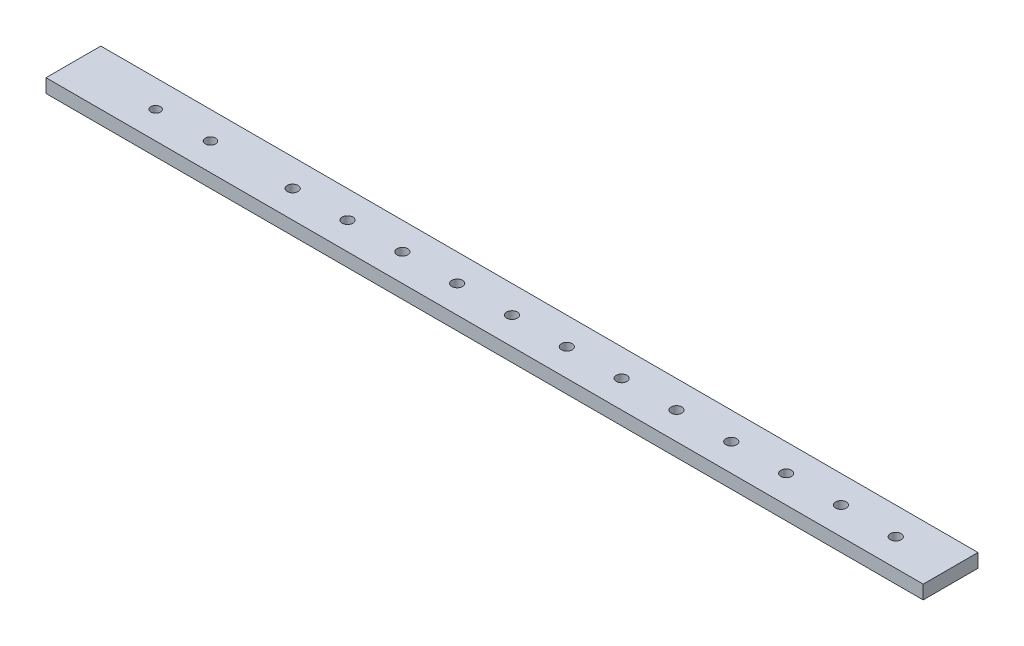
ISO-10303-21;
HEADER;
FILE_DESCRIPTION(('STEP AP214'),'2;1');
FILE_NAME('part.step','',(''),(''),'','','');
FILE_SCHEMA(('AUTOMOTIVE_DESIGN { 1 0 10303 214 1 1 1 1 }'));
ENDSEC;
DATA;
#1=APPLICATION_CONTEXT('core data for automotive mechanical design processes');
#2=APPLICATION_PROTOCOL_DEFINITION('international standard','automotive_design',2000,#1);
#3=PRODUCT_CONTEXT('',#1,'mechanical');
#4=PRODUCT('Part','Part','',(#3));
#5=PRODUCT_RELATED_PRODUCT_CATEGORY('part','',(#4));
#6=PRODUCT_DEFINITION_FORMATION('','',#4);
#7=PRODUCT_DEFINITION_CONTEXT('part definition',#1,'design');
#8=PRODUCT_DEFINITION('design','',#6,#7);
#9=PRODUCT_DEFINITION_SHAPE('','',#8);
#10=(LENGTH_UNIT() NAMED_UNIT(*) SI_UNIT(.MILLI.,.METRE.));
#11=(NAMED_UNIT(*) PLANE_ANGLE_UNIT() SI_UNIT($,.RADIAN.));
#12=(NAMED_UNIT(*) SI_UNIT($,.STERADIAN.) SOLID_ANGLE_UNIT());
#13=UNCERTAINTY_MEASURE_WITH_UNIT(LENGTH_MEASURE(1.E-05),#10,'distance_accuracy_value','');
#14=(GEOMETRIC_REPRESENTATION_CONTEXT(3) GLOBAL_UNCERTAINTY_ASSIGNED_CONTEXT((#13)) GLOBAL_UNIT_ASSIGNED_CONTEXT((#10,
#11,#12)) REPRESENTATION_CONTEXT('',''));
#15=CARTESIAN_POINT('',(0.,0.,0.));
#16=DIRECTION('',(0.,0.,1.));
#17=DIRECTION('',(1.,0.,0.));
#18=AXIS2_PLACEMENT_3D('',#15,#16,#17);
#19=CARTESIAN_POINT('',(0.,6.35,0.));
#20=DIRECTION('',(1.,0.,0.));
#21=DIRECTION('',(0.,0.,-1.));
#22=AXIS2_PLACEMENT_3D('',#19,#20,#21);
#23=PLANE('',#22);
#24=DIRECTION('',(0.,0.,1.));
#25=VECTOR('',#24,1.);
#26=CARTESIAN_POINT('',(0.,0.,0.));
#27=LINE('',#26,#25);
#28=CARTESIAN_POINT('',(0.,0.,-25.4));
#29=VERTEX_POINT('',#28);
#30=CARTESIAN_POINT('',(0.,0.,0.));
#31=VERTEX_POINT('',#30);
#32=EDGE_CURVE('E96',#29,#31,#27,.T.);
#33=ORIENTED_EDGE('',*,*,#32,.T.);
#34=DIRECTION('',(0.,-1.,0.));
#35=VECTOR('',#34,1.);
#36=CARTESIAN_POINT('',(0.,6.35,0.));
#37=LINE('',#36,#35);
#38=CARTESIAN_POINT('',(0.,6.35,0.));
#39=VERTEX_POINT('',#38);
#40=EDGE_CURVE('E11',#39,#31,#37,.T.);
#41=ORIENTED_EDGE('',*,*,#40,.F.);
#42=DIRECTION('',(0.,0.,1.));
#43=VECTOR('',#42,1.);
#44=CARTESIAN_POINT('',(0.,6.35,0.));
#45=LINE('',#44,#43);
#46=CARTESIAN_POINT('',(0.,6.35,-25.4));
#47=VERTEX_POINT('',#46);
#48=EDGE_CURVE('E84',#47,#39,#45,.T.);
#49=ORIENTED_EDGE('',*,*,#48,.F.);
#50=DIRECTION('',(0.,-1.,0.));
#51=VECTOR('',#50,1.);
#52=CARTESIAN_POINT('',(0.,6.35,-25.4));
#53=LINE('',#52,#51);
#54=EDGE_CURVE('E92',#47,#29,#53,.T.);
#55=ORIENTED_EDGE('',*,*,#54,.T.);
#56=EDGE_LOOP('',(#33,#41,#49,#55));
#57=FACE_BOUND('',#56,.T.);
#58=ADVANCED_FACE('F33',(#57),#23,.F.);
#59=CARTESIAN_POINT('',(0.,6.35,0.));
#60=DIRECTION('',(0.,0.,-1.));
#61=DIRECTION('',(-1.,0.,0.));
#62=AXIS2_PLACEMENT_3D('',#59,#60,#61);
#63=PLANE('',#62);
#64=DIRECTION('',(1.,0.,0.));
#65=VECTOR('',#64,1.);
#66=CARTESIAN_POINT('',(0.,0.,0.));
#67=LINE('',#66,#65);
#68=CARTESIAN_POINT('',(406.4,0.,0.));
#69=VERTEX_POINT('',#68);
#70=EDGE_CURVE('E88',#31,#69,#67,.T.);
#71=ORIENTED_EDGE('',*,*,#70,.T.);
#72=DIRECTION('',(0.,-1.,0.));
#73=VECTOR('',#72,1.);
#74=CARTESIAN_POINT('',(406.4,6.35,0.));
#75=LINE('',#74,#73);
#76=CARTESIAN_POINT('',(406.4,6.35,0.));
#77=VERTEX_POINT('',#76);
#78=EDGE_CURVE('E41',#77,#69,#75,.T.);
#79=ORIENTED_EDGE('',*,*,#78,.F.);
#80=DIRECTION('',(1.,0.,0.));
#81=VECTOR('',#80,1.);
#82=CARTESIAN_POINT('',(0.,6.35,0.));
#83=LINE('',#82,#81);
#84=EDGE_CURVE('E79',#39,#77,#83,.T.);
#85=ORIENTED_EDGE('',*,*,#84,.F.);
#86=ORIENTED_EDGE('',*,*,#40,.T.);
#87=EDGE_LOOP('',(#71,#79,#85,#86));
#88=FACE_BOUND('',#87,.T.);
#89=ADVANCED_FACE('F87',(#88),#63,.F.);
#90=CARTESIAN_POINT('',(406.4,6.35,0.));
#91=DIRECTION('',(-1.,0.,0.));
#92=DIRECTION('',(0.,0.,1.));
#93=AXIS2_PLACEMENT_3D('',#90,#91,#92);
#94=PLANE('',#93);
#95=DIRECTION('',(0.,0.,-1.));
#96=VECTOR('',#95,1.);
#97=CARTESIAN_POINT('',(406.4,0.,0.));
#98=LINE('',#97,#96);
#99=CARTESIAN_POINT('',(406.4,0.,-25.4));
#100=VERTEX_POINT('',#99);
#101=EDGE_CURVE('E66',#69,#100,#98,.T.);
#102=ORIENTED_EDGE('',*,*,#101,.T.);
#103=DIRECTION('',(0.,-1.,0.));
#104=VECTOR('',#103,1.);
#105=CARTESIAN_POINT('',(406.4,6.35,-25.4));
#106=LINE('',#105,#104);
#107=CARTESIAN_POINT('',(406.4,6.35,-25.4));
#108=VERTEX_POINT('',#107);
#109=EDGE_CURVE('E89',#108,#100,#106,.T.);
#110=ORIENTED_EDGE('',*,*,#109,.F.);
#111=DIRECTION('',(0.,0.,-1.));
#112=VECTOR('',#111,1.);
#113=CARTESIAN_POINT('',(406.4,6.35,0.));
#114=LINE('',#113,#112);
#115=EDGE_CURVE('E82',#77,#108,#114,.T.);
#116=ORIENTED_EDGE('',*,*,#115,.F.);
#117=ORIENTED_EDGE('',*,*,#78,.T.);
#118=EDGE_LOOP('',(#102,#110,#116,#117));
#119=FACE_BOUND('',#118,.T.);
#120=ADVANCED_FACE('F90',(#119),#94,.F.);
#121=CARTESIAN_POINT('',(0.,6.35,-25.4));
#122=DIRECTION('',(0.,0.,1.));
#123=DIRECTION('',(1.,0.,0.));
#124=AXIS2_PLACEMENT_3D('',#121,#122,#123);
#125=PLANE('',#124);
#126=DIRECTION('',(-1.,0.,0.));
#127=VECTOR('',#126,1.);
#128=CARTESIAN_POINT('',(0.,0.,-25.4));
#129=LINE('',#128,#127);
#130=EDGE_CURVE('E72',#100,#29,#129,.T.);
#131=ORIENTED_EDGE('',*,*,#130,.T.);
#132=ORIENTED_EDGE('',*,*,#54,.F.);
#133=DIRECTION('',(-1.,0.,0.));
#134=VECTOR('',#133,1.);
#135=CARTESIAN_POINT('',(0.,6.35,-25.4));
#136=LINE('',#135,#134);
#137=EDGE_CURVE('E49',#108,#47,#136,.T.);
#138=ORIENTED_EDGE('',*,*,#137,.F.);
#139=ORIENTED_EDGE('',*,*,#109,.T.);
#140=EDGE_LOOP('',(#131,#132,#138,#139));
#141=FACE_BOUND('',#140,.T.);
#142=ADVANCED_FACE('F104',(#141),#125,.F.);
#143=CARTESIAN_POINT('',(0.,6.35,0.));
#144=DIRECTION('',(0.,-1.,0.));
#145=DIRECTION('',(0.,0.,-1.));
#146=AXIS2_PLACEMENT_3D('',#143,#144,#145);
#147=PLANE('',#146);
#148=CARTESIAN_POINT('',(63.4999999999983,6.35,-12.7000000000005));
#149=DIRECTION('',(0.,-1.,0.));
#150=DIRECTION('',(0.,0.,-1.));
#151=AXIS2_PLACEMENT_3D('',#148,#149,#150);
#152=CIRCLE('',#151,2.37807027929824);
#153=CARTESIAN_POINT('',(63.4999999999983,6.35,-15.0780702792988));
#154=VERTEX_POINT('',#153);
#155=EDGE_CURVE('E114',#154,#154,#152,.T.);
#156=ORIENTED_EDGE('',*,*,#155,.T.);
#157=EDGE_LOOP('',(#156));
#158=FACE_BOUND('',#157,.T.);
#159=CARTESIAN_POINT('',(38.0999999999999,6.35,-12.7000000000003));
#160=DIRECTION('',(0.,-1.,0.));
#161=DIRECTION('',(0.,0.,-1.));
#162=AXIS2_PLACEMENT_3D('',#159,#160,#161);
#163=CIRCLE('',#162,2.20737702969535);
#164=CARTESIAN_POINT('',(38.0999999999999,6.35,-14.9073770296957));
#165=VERTEX_POINT('',#164);
#166=EDGE_CURVE('E185',#165,#165,#163,.T.);
#167=ORIENTED_EDGE('',*,*,#166,.T.);
#168=EDGE_LOOP('',(#167));
#169=FACE_BOUND('',#168,.T.);
#170=CARTESIAN_POINT('',(381.,6.35,-12.7));
#171=DIRECTION('',(0.,1.,0.));
#172=DIRECTION('',(0.,0.,1.));
#173=AXIS2_PLACEMENT_3D('',#170,#171,#172);
#174=CIRCLE('',#173,2.48920000000001);
#175=CARTESIAN_POINT('',(381.,6.35,-10.2108));
#176=VERTEX_POINT('',#175);
#177=EDGE_CURVE('E177',#176,#176,#174,.T.);
#178=ORIENTED_EDGE('',*,*,#177,.F.);
#179=EDGE_LOOP('',(#178));
#180=FACE_BOUND('',#179,.T.);
#181=CARTESIAN_POINT('',(355.6,6.35,-12.7));
#182=DIRECTION('',(0.,1.,0.));
#183=DIRECTION('',(0.,0.,1.));
#184=AXIS2_PLACEMENT_3D('',#181,#182,#183);
#185=CIRCLE('',#184,2.48920000000001);
#186=CARTESIAN_POINT('',(355.6,6.35,-10.2108));
#187=VERTEX_POINT('',#186);
#188=EDGE_CURVE('E171',#187,#187,#185,.T.);
#189=ORIENTED_EDGE('',*,*,#188,.F.);
#190=EDGE_LOOP('',(#189));
#191=FACE_BOUND('',#190,.T.);
#192=CARTESIAN_POINT('',(330.2,6.35,-12.7));
#193=DIRECTION('',(0.,1.,0.));
#194=DIRECTION('',(0.,0.,1.));
#195=AXIS2_PLACEMENT_3D('',#192,#193,#194);
#196=CIRCLE('',#195,2.48920000000001);
#197=CARTESIAN_POINT('',(330.2,6.35,-10.2108));
#198=VERTEX_POINT('',#197);
#199=EDGE_CURVE('E165',#198,#198,#196,.T.);
#200=ORIENTED_EDGE('',*,*,#199,.F.);
#201=EDGE_LOOP('',(#200));
#202=FACE_BOUND('',#201,.T.);
#203=CARTESIAN_POINT('',(304.8,6.35,-12.7));
#204=DIRECTION('',(0.,1.,0.));
#205=DIRECTION('',(0.,0.,1.));
#206=AXIS2_PLACEMENT_3D('',#203,#204,#205);
#207=CIRCLE('',#206,2.48920000000001);
#208=CARTESIAN_POINT('',(304.8,6.35,-10.2108));
#209=VERTEX_POINT('',#208);
#210=EDGE_CURVE('E159',#209,#209,#207,.T.);
#211=ORIENTED_EDGE('',*,*,#210,.F.);
#212=EDGE_LOOP('',(#211));
#213=FACE_BOUND('',#212,.T.);
#214=CARTESIAN_POINT('',(279.4,6.35,-12.7));
#215=DIRECTION('',(0.,1.,0.));
#216=DIRECTION('',(0.,0.,1.));
#217=AXIS2_PLACEMENT_3D('',#214,#215,#216);
#218=CIRCLE('',#217,2.48920000000001);
#219=CARTESIAN_POINT('',(279.4,6.35,-10.2108));
#220=VERTEX_POINT('',#219);
#221=EDGE_CURVE('E153',#220,#220,#218,.T.);
#222=ORIENTED_EDGE('',*,*,#221,.F.);
#223=EDGE_LOOP('',(#222));
#224=FACE_BOUND('',#223,.T.);
#225=CARTESIAN_POINT('',(254.,6.35,-12.7));
#226=DIRECTION('',(0.,1.,0.));
#227=DIRECTION('',(0.,0.,1.));
#228=AXIS2_PLACEMENT_3D('',#225,#226,#227);
#229=CIRCLE('',#228,2.48920000000001);
#230=CARTESIAN_POINT('',(254.,6.35,-10.2108));
#231=VERTEX_POINT('',#230);
#232=EDGE_CURVE('E147',#231,#231,#229,.T.);
#233=ORIENTED_EDGE('',*,*,#232,.F.);
#234=EDGE_LOOP('',(#233));
#235=FACE_BOUND('',#234,.T.);
#236=CARTESIAN_POINT('',(228.6,6.35,-12.7));
#237=DIRECTION('',(0.,1.,0.));
#238=DIRECTION('',(0.,0.,1.));
#239=AXIS2_PLACEMENT_3D('',#236,#237,#238);
#240=CIRCLE('',#239,2.4892);
#241=CARTESIAN_POINT('',(228.6,6.35,-10.2108));
#242=VERTEX_POINT('',#241);
#243=EDGE_CURVE('E141',#242,#242,#240,.T.);
#244=ORIENTED_EDGE('',*,*,#243,.F.);
#245=EDGE_LOOP('',(#244));
#246=FACE_BOUND('',#245,.T.);
#247=CARTESIAN_POINT('',(203.2,6.35,-12.7));
#248=DIRECTION('',(0.,1.,0.));
#249=DIRECTION('',(0.,0.,1.));
#250=AXIS2_PLACEMENT_3D('',#247,#248,#249);
#251=CIRCLE('',#250,2.4892);
#252=CARTESIAN_POINT('',(203.2,6.35,-10.2108));
#253=VERTEX_POINT('',#252);
#254=EDGE_CURVE('E135',#253,#253,#251,.T.);
#255=ORIENTED_EDGE('',*,*,#254,.F.);
#256=EDGE_LOOP('',(#255));
#257=FACE_BOUND('',#256,.T.);
#258=CARTESIAN_POINT('',(177.8,6.35,-12.7));
#259=DIRECTION('',(0.,1.,0.));
#260=DIRECTION('',(0.,0.,1.));
#261=AXIS2_PLACEMENT_3D('',#258,#259,#260);
#262=CIRCLE('',#261,2.4892);
#263=CARTESIAN_POINT('',(177.8,6.35,-10.2108));
#264=VERTEX_POINT('',#263);
#265=EDGE_CURVE('E129',#264,#264,#262,.T.);
#266=ORIENTED_EDGE('',*,*,#265,.F.);
#267=EDGE_LOOP('',(#266));
#268=FACE_BOUND('',#267,.T.);
#269=CARTESIAN_POINT('',(152.4,6.35,-12.7));
#270=DIRECTION('',(0.,1.,0.));
#271=DIRECTION('',(0.,0.,1.));
#272=AXIS2_PLACEMENT_3D('',#269,#270,#271);
#273=CIRCLE('',#272,2.4892);
#274=CARTESIAN_POINT('',(152.4,6.35,-10.2108));
#275=VERTEX_POINT('',#274);
#276=EDGE_CURVE('E123',#275,#275,#273,.T.);
#277=ORIENTED_EDGE('',*,*,#276,.F.);
#278=EDGE_LOOP('',(#277));
#279=FACE_BOUND('',#278,.T.);
#280=CARTESIAN_POINT('',(127.,6.35,-12.7));
#281=DIRECTION('',(0.,1.,0.));
#282=DIRECTION('',(0.,0.,1.));
#283=AXIS2_PLACEMENT_3D('',#280,#281,#282);
#284=CIRCLE('',#283,2.4892);
#285=CARTESIAN_POINT('',(127.,6.35,-10.2108));
#286=VERTEX_POINT('',#285);
#287=EDGE_CURVE('E117',#286,#286,#284,.T.);
#288=ORIENTED_EDGE('',*,*,#287,.F.);
#289=EDGE_LOOP('',(#288));
#290=FACE_BOUND('',#289,.T.);
#291=CARTESIAN_POINT('',(101.6,6.35,-12.7));
#292=DIRECTION('',(0.,1.,0.));
#293=DIRECTION('',(0.,0.,1.));
#294=AXIS2_PLACEMENT_3D('',#291,#292,#293);
#295=CIRCLE('',#294,2.4892);
#296=CARTESIAN_POINT('',(101.6,6.35,-10.2108));
#297=VERTEX_POINT('',#296);
#298=EDGE_CURVE('E110',#297,#297,#295,.T.);
#299=ORIENTED_EDGE('',*,*,#298,.F.);
#300=EDGE_LOOP('',(#299));
#301=FACE_BOUND('',#300,.T.);
#302=ORIENTED_EDGE('',*,*,#48,.T.);
#303=ORIENTED_EDGE('',*,*,#84,.T.);
#304=ORIENTED_EDGE('',*,*,#115,.T.);
#305=ORIENTED_EDGE('',*,*,#137,.T.);
#306=EDGE_LOOP('',(#302,#303,#304,#305));
#307=FACE_BOUND('',#306,.T.);
#308=ADVANCED_FACE('F80',(#158,#169,#180,#191,#202,#213,#224,#235,#246,#257,#268,#279,#290,#301,
#307),#147,.F.);
#309=CARTESIAN_POINT('',(0.,0.,0.));
#310=DIRECTION('',(0.,-1.,0.));
#311=DIRECTION('',(0.,0.,-1.));
#312=AXIS2_PLACEMENT_3D('',#309,#310,#311);
#313=PLANE('',#312);
#314=CARTESIAN_POINT('',(63.4999999999983,0.,-12.7000000000005));
#315=DIRECTION('',(0.,-1.,0.));
#316=DIRECTION('',(0.,0.,-1.));
#317=AXIS2_PLACEMENT_3D('',#314,#315,#316);
#318=CIRCLE('',#317,2.37807027929824);
#319=CARTESIAN_POINT('',(63.4999999999983,0.,-15.0780702792988));
#320=VERTEX_POINT('',#319);
#321=EDGE_CURVE('E188',#320,#320,#318,.T.);
#322=ORIENTED_EDGE('',*,*,#321,.F.);
#323=EDGE_LOOP('',(#322));
#324=FACE_BOUND('',#323,.T.);
#325=CARTESIAN_POINT('',(38.0999999999999,0.,-12.7000000000003));
#326=DIRECTION('',(0.,-1.,0.));
#327=DIRECTION('',(0.,0.,-1.));
#328=AXIS2_PLACEMENT_3D('',#325,#326,#327);
#329=CIRCLE('',#328,2.20737702969535);
#330=CARTESIAN_POINT('',(38.0999999999999,0.,-14.9073770296957));
#331=VERTEX_POINT('',#330);
#332=EDGE_CURVE('E182',#331,#331,#329,.T.);
#333=ORIENTED_EDGE('',*,*,#332,.F.);
#334=EDGE_LOOP('',(#333));
#335=FACE_BOUND('',#334,.T.);
#336=CARTESIAN_POINT('',(381.,0.,-12.7));
#337=DIRECTION('',(0.,1.,0.));
#338=DIRECTION('',(0.,0.,1.));
#339=AXIS2_PLACEMENT_3D('',#336,#337,#338);
#340=CIRCLE('',#339,2.48920000000001);
#341=CARTESIAN_POINT('',(381.,0.,-10.2108));
#342=VERTEX_POINT('',#341);
#343=EDGE_CURVE('E99',#342,#342,#340,.T.);
#344=ORIENTED_EDGE('',*,*,#343,.T.);
#345=EDGE_LOOP('',(#344));
#346=FACE_BOUND('',#345,.T.);
#347=CARTESIAN_POINT('',(355.6,0.,-12.7));
#348=DIRECTION('',(0.,1.,0.));
#349=DIRECTION('',(0.,0.,1.));
#350=AXIS2_PLACEMENT_3D('',#347,#348,#349);
#351=CIRCLE('',#350,2.48920000000001);
#352=CARTESIAN_POINT('',(355.6,0.,-10.2108));
#353=VERTEX_POINT('',#352);
#354=EDGE_CURVE('E174',#353,#353,#351,.T.);
#355=ORIENTED_EDGE('',*,*,#354,.T.);
#356=EDGE_LOOP('',(#355));
#357=FACE_BOUND('',#356,.T.);
#358=CARTESIAN_POINT('',(330.2,0.,-12.7));
#359=DIRECTION('',(0.,1.,0.));
#360=DIRECTION('',(0.,0.,1.));
#361=AXIS2_PLACEMENT_3D('',#358,#359,#360);
#362=CIRCLE('',#361,2.48920000000001);
#363=CARTESIAN_POINT('',(330.2,0.,-10.2108));
#364=VERTEX_POINT('',#363);
#365=EDGE_CURVE('E168',#364,#364,#362,.T.);
#366=ORIENTED_EDGE('',*,*,#365,.T.);
#367=EDGE_LOOP('',(#366));
#368=FACE_BOUND('',#367,.T.);
#369=CARTESIAN_POINT('',(304.8,0.,-12.7));
#370=DIRECTION('',(0.,1.,0.));
#371=DIRECTION('',(0.,0.,1.));
#372=AXIS2_PLACEMENT_3D('',#369,#370,#371);
#373=CIRCLE('',#372,2.48920000000001);
#374=CARTESIAN_POINT('',(304.8,0.,-10.2108));
#375=VERTEX_POINT('',#374);
#376=EDGE_CURVE('E162',#375,#375,#373,.T.);
#377=ORIENTED_EDGE('',*,*,#376,.T.);
#378=EDGE_LOOP('',(#377));
#379=FACE_BOUND('',#378,.T.);
#380=CARTESIAN_POINT('',(279.4,0.,-12.7));
#381=DIRECTION('',(0.,1.,0.));
#382=DIRECTION('',(0.,0.,1.));
#383=AXIS2_PLACEMENT_3D('',#380,#381,#382);
#384=CIRCLE('',#383,2.48920000000001);
#385=CARTESIAN_POINT('',(279.4,0.,-10.2108));
#386=VERTEX_POINT('',#385);
#387=EDGE_CURVE('E156',#386,#386,#384,.T.);
#388=ORIENTED_EDGE('',*,*,#387,.T.);
#389=EDGE_LOOP('',(#388));
#390=FACE_BOUND('',#389,.T.);
#391=CARTESIAN_POINT('',(254.,0.,-12.7));
#392=DIRECTION('',(0.,1.,0.));
#393=DIRECTION('',(0.,0.,1.));
#394=AXIS2_PLACEMENT_3D('',#391,#392,#393);
#395=CIRCLE('',#394,2.48920000000001);
#396=CARTESIAN_POINT('',(254.,0.,-10.2108));
#397=VERTEX_POINT('',#396);
#398=EDGE_CURVE('E150',#397,#397,#395,.T.);
#399=ORIENTED_EDGE('',*,*,#398,.T.);
#400=EDGE_LOOP('',(#399));
#401=FACE_BOUND('',#400,.T.);
#402=CARTESIAN_POINT('',(228.6,0.,-12.7));
#403=DIRECTION('',(0.,1.,0.));
#404=DIRECTION('',(0.,0.,1.));
#405=AXIS2_PLACEMENT_3D('',#402,#403,#404);
#406=CIRCLE('',#405,2.4892);
#407=CARTESIAN_POINT('',(228.6,0.,-10.2108));
#408=VERTEX_POINT('',#407);
#409=EDGE_CURVE('E144',#408,#408,#406,.T.);
#410=ORIENTED_EDGE('',*,*,#409,.T.);
#411=EDGE_LOOP('',(#410));
#412=FACE_BOUND('',#411,.T.);
#413=CARTESIAN_POINT('',(203.2,0.,-12.7));
#414=DIRECTION('',(0.,1.,0.));
#415=DIRECTION('',(0.,0.,1.));
#416=AXIS2_PLACEMENT_3D('',#413,#414,#415);
#417=CIRCLE('',#416,2.4892);
#418=CARTESIAN_POINT('',(203.2,0.,-10.2108));
#419=VERTEX_POINT('',#418);
#420=EDGE_CURVE('E138',#419,#419,#417,.T.);
#421=ORIENTED_EDGE('',*,*,#420,.T.);
#422=EDGE_LOOP('',(#421));
#423=FACE_BOUND('',#422,.T.);
#424=CARTESIAN_POINT('',(177.8,0.,-12.7));
#425=DIRECTION('',(0.,1.,0.));
#426=DIRECTION('',(0.,0.,1.));
#427=AXIS2_PLACEMENT_3D('',#424,#425,#426);
#428=CIRCLE('',#427,2.4892);
#429=CARTESIAN_POINT('',(177.8,0.,-10.2108));
#430=VERTEX_POINT('',#429);
#431=EDGE_CURVE('E132',#430,#430,#428,.T.);
#432=ORIENTED_EDGE('',*,*,#431,.T.);
#433=EDGE_LOOP('',(#432));
#434=FACE_BOUND('',#433,.T.);
#435=CARTESIAN_POINT('',(152.4,0.,-12.7));
#436=DIRECTION('',(0.,1.,0.));
#437=DIRECTION('',(0.,0.,1.));
#438=AXIS2_PLACEMENT_3D('',#435,#436,#437);
#439=CIRCLE('',#438,2.4892);
#440=CARTESIAN_POINT('',(152.4,0.,-10.2108));
#441=VERTEX_POINT('',#440);
#442=EDGE_CURVE('E126',#441,#441,#439,.T.);
#443=ORIENTED_EDGE('',*,*,#442,.T.);
#444=EDGE_LOOP('',(#443));
#445=FACE_BOUND('',#444,.T.);
#446=CARTESIAN_POINT('',(127.,0.,-12.7));
#447=DIRECTION('',(0.,1.,0.));
#448=DIRECTION('',(0.,0.,1.));
#449=AXIS2_PLACEMENT_3D('',#446,#447,#448);
#450=CIRCLE('',#449,2.4892);
#451=CARTESIAN_POINT('',(127.,0.,-10.2108));
#452=VERTEX_POINT('',#451);
#453=EDGE_CURVE('E120',#452,#452,#450,.T.);
#454=ORIENTED_EDGE('',*,*,#453,.T.);
#455=EDGE_LOOP('',(#454));
#456=FACE_BOUND('',#455,.T.);
#457=CARTESIAN_POINT('',(101.6,0.,-12.7));
#458=DIRECTION('',(0.,1.,0.));
#459=DIRECTION('',(0.,0.,1.));
#460=AXIS2_PLACEMENT_3D('',#457,#458,#459);
#461=CIRCLE('',#460,2.4892);
#462=CARTESIAN_POINT('',(101.6,0.,-10.2108));
#463=VERTEX_POINT('',#462);
#464=EDGE_CURVE('E113',#463,#463,#461,.T.);
#465=ORIENTED_EDGE('',*,*,#464,.T.);
#466=EDGE_LOOP('',(#465));
#467=FACE_BOUND('',#466,.T.);
#468=ORIENTED_EDGE('',*,*,#32,.F.);
#469=ORIENTED_EDGE('',*,*,#130,.F.);
#470=ORIENTED_EDGE('',*,*,#101,.F.);
#471=ORIENTED_EDGE('',*,*,#70,.F.);
#472=EDGE_LOOP('',(#468,#469,#470,#471));
#473=FACE_BOUND('',#472,.T.);
#474=ADVANCED_FACE('F107',(#324,#335,#346,#357,#368,#379,#390,#401,#412,#423,#434,#445,#456,
#467,#473),#313,.T.);
#475=CARTESIAN_POINT('',(101.6,0.,-12.7));
#476=DIRECTION('',(0.,1.,0.));
#477=DIRECTION('',(0.,0.,1.));
#478=AXIS2_PLACEMENT_3D('',#475,#476,#477);
#479=CYLINDRICAL_SURFACE('',#478,2.4892);
#480=ORIENTED_EDGE('',*,*,#464,.F.);
#481=EDGE_LOOP('',(#480));
#482=FACE_BOUND('',#481,.T.);
#483=ORIENTED_EDGE('',*,*,#298,.T.);
#484=EDGE_LOOP('',(#483));
#485=FACE_BOUND('',#484,.T.);
#486=ADVANCED_FACE('F205',(#482,#485),#479,.F.);
#487=CARTESIAN_POINT('',(127.,0.,-12.7));
#488=DIRECTION('',(0.,1.,0.));
#489=DIRECTION('',(0.,0.,1.));
#490=AXIS2_PLACEMENT_3D('',#487,#488,#489);
#491=CYLINDRICAL_SURFACE('',#490,2.4892);
#492=ORIENTED_EDGE('',*,*,#453,.F.);
#493=EDGE_LOOP('',(#492));
#494=FACE_BOUND('',#493,.T.);
#495=ORIENTED_EDGE('',*,*,#287,.T.);
#496=EDGE_LOOP('',(#495));
#497=FACE_BOUND('',#496,.T.);
#498=ADVANCED_FACE('F235',(#494,#497),#491,.F.);
#499=CARTESIAN_POINT('',(152.4,0.,-12.7));
#500=DIRECTION('',(0.,1.,0.));
#501=DIRECTION('',(0.,0.,1.));
#502=AXIS2_PLACEMENT_3D('',#499,#500,#501);
#503=CYLINDRICAL_SURFACE('',#502,2.4892);
#504=ORIENTED_EDGE('',*,*,#442,.F.);
#505=EDGE_LOOP('',(#504));
#506=FACE_BOUND('',#505,.T.);
#507=ORIENTED_EDGE('',*,*,#276,.T.);
#508=EDGE_LOOP('',(#507));
#509=FACE_BOUND('',#508,.T.);
#510=ADVANCED_FACE('F281',(#506,#509),#503,.F.);
#511=CARTESIAN_POINT('',(177.8,0.,-12.7));
#512=DIRECTION('',(0.,1.,0.));
#513=DIRECTION('',(0.,0.,1.));
#514=AXIS2_PLACEMENT_3D('',#511,#512,#513);
#515=CYLINDRICAL_SURFACE('',#514,2.4892);
#516=ORIENTED_EDGE('',*,*,#431,.F.);
#517=EDGE_LOOP('',(#516));
#518=FACE_BOUND('',#517,.T.);
#519=ORIENTED_EDGE('',*,*,#265,.T.);
#520=EDGE_LOOP('',(#519));
#521=FACE_BOUND('',#520,.T.);
#522=ADVANCED_FACE('F289',(#518,#521),#515,.F.);
#523=CARTESIAN_POINT('',(203.2,0.,-12.7));
#524=DIRECTION('',(0.,1.,0.));
#525=DIRECTION('',(0.,0.,1.));
#526=AXIS2_PLACEMENT_3D('',#523,#524,#525);
#527=CYLINDRICAL_SURFACE('',#526,2.4892);
#528=ORIENTED_EDGE('',*,*,#420,.F.);
#529=EDGE_LOOP('',(#528));
#530=FACE_BOUND('',#529,.T.);
#531=ORIENTED_EDGE('',*,*,#254,.T.);
#532=EDGE_LOOP('',(#531));
#533=FACE_BOUND('',#532,.T.);
#534=ADVANCED_FACE('F297',(#530,#533),#527,.F.);
#535=CARTESIAN_POINT('',(228.6,0.,-12.7));
#536=DIRECTION('',(0.,1.,0.));
#537=DIRECTION('',(0.,0.,1.));
#538=AXIS2_PLACEMENT_3D('',#535,#536,#537);
#539=CYLINDRICAL_SURFACE('',#538,2.4892);
#540=ORIENTED_EDGE('',*,*,#409,.F.);
#541=EDGE_LOOP('',(#540));
#542=FACE_BOUND('',#541,.T.);
#543=ORIENTED_EDGE('',*,*,#243,.T.);
#544=EDGE_LOOP('',(#543));
#545=FACE_BOUND('',#544,.T.);
#546=ADVANCED_FACE('F305',(#542,#545),#539,.F.);
#547=CARTESIAN_POINT('',(254.,0.,-12.7));
#548=DIRECTION('',(0.,1.,0.));
#549=DIRECTION('',(0.,0.,1.));
#550=AXIS2_PLACEMENT_3D('',#547,#548,#549);
#551=CYLINDRICAL_SURFACE('',#550,2.48920000000001);
#552=ORIENTED_EDGE('',*,*,#398,.F.);
#553=EDGE_LOOP('',(#552));
#554=FACE_BOUND('',#553,.T.);
#555=ORIENTED_EDGE('',*,*,#232,.T.);
#556=EDGE_LOOP('',(#555));
#557=FACE_BOUND('',#556,.T.);
#558=ADVANCED_FACE('F313',(#554,#557),#551,.F.);
#559=CARTESIAN_POINT('',(279.4,0.,-12.7));
#560=DIRECTION('',(0.,1.,0.));
#561=DIRECTION('',(0.,0.,1.));
#562=AXIS2_PLACEMENT_3D('',#559,#560,#561);
#563=CYLINDRICAL_SURFACE('',#562,2.48920000000001);
#564=ORIENTED_EDGE('',*,*,#387,.F.);
#565=EDGE_LOOP('',(#564));
#566=FACE_BOUND('',#565,.T.);
#567=ORIENTED_EDGE('',*,*,#221,.T.);
#568=EDGE_LOOP('',(#567));
#569=FACE_BOUND('',#568,.T.);
#570=ADVANCED_FACE('F321',(#566,#569),#563,.F.);
#571=CARTESIAN_POINT('',(304.8,0.,-12.7));
#572=DIRECTION('',(0.,1.,0.));
#573=DIRECTION('',(0.,0.,1.));
#574=AXIS2_PLACEMENT_3D('',#571,#572,#573);
#575=CYLINDRICAL_SURFACE('',#574,2.48920000000001);
#576=ORIENTED_EDGE('',*,*,#376,.F.);
#577=EDGE_LOOP('',(#576));
#578=FACE_BOUND('',#577,.T.);
#579=ORIENTED_EDGE('',*,*,#210,.T.);
#580=EDGE_LOOP('',(#579));
#581=FACE_BOUND('',#580,.T.);
#582=ADVANCED_FACE('F329',(#578,#581),#575,.F.);
#583=CARTESIAN_POINT('',(330.2,0.,-12.7));
#584=DIRECTION('',(0.,1.,0.));
#585=DIRECTION('',(0.,0.,1.));
#586=AXIS2_PLACEMENT_3D('',#583,#584,#585);
#587=CYLINDRICAL_SURFACE('',#586,2.48920000000001);
#588=ORIENTED_EDGE('',*,*,#365,.F.);
#589=EDGE_LOOP('',(#588));
#590=FACE_BOUND('',#589,.T.);
#591=ORIENTED_EDGE('',*,*,#199,.T.);
#592=EDGE_LOOP('',(#591));
#593=FACE_BOUND('',#592,.T.);
#594=ADVANCED_FACE('F337',(#590,#593),#587,.F.);
#595=CARTESIAN_POINT('',(355.6,0.,-12.7));
#596=DIRECTION('',(0.,1.,0.));
#597=DIRECTION('',(0.,0.,1.));
#598=AXIS2_PLACEMENT_3D('',#595,#596,#597);
#599=CYLINDRICAL_SURFACE('',#598,2.48920000000001);
#600=ORIENTED_EDGE('',*,*,#354,.F.);
#601=EDGE_LOOP('',(#600));
#602=FACE_BOUND('',#601,.T.);
#603=ORIENTED_EDGE('',*,*,#188,.T.);
#604=EDGE_LOOP('',(#603));
#605=FACE_BOUND('',#604,.T.);
#606=ADVANCED_FACE('F345',(#602,#605),#599,.F.);
#607=CARTESIAN_POINT('',(381.,0.,-12.7));
#608=DIRECTION('',(0.,1.,0.));
#609=DIRECTION('',(0.,0.,1.));
#610=AXIS2_PLACEMENT_3D('',#607,#608,#609);
#611=CYLINDRICAL_SURFACE('',#610,2.48920000000001);
#612=ORIENTED_EDGE('',*,*,#343,.F.);
#613=EDGE_LOOP('',(#612));
#614=FACE_BOUND('',#613,.T.);
#615=ORIENTED_EDGE('',*,*,#177,.T.);
#616=EDGE_LOOP('',(#615));
#617=FACE_BOUND('',#616,.T.);
#618=ADVANCED_FACE('F353',(#614,#617),#611,.F.);
#619=CARTESIAN_POINT('',(38.0999999999999,6.35,-12.7000000000003));
#620=DIRECTION('',(0.,-1.,0.));
#621=DIRECTION('',(0.,0.,-1.));
#622=AXIS2_PLACEMENT_3D('',#619,#620,#621);
#623=CYLINDRICAL_SURFACE('',#622,2.20737702969535);
#624=ORIENTED_EDGE('',*,*,#166,.F.);
#625=EDGE_LOOP('',(#624));
#626=FACE_BOUND('',#625,.T.);
#627=ORIENTED_EDGE('',*,*,#332,.T.);
#628=EDGE_LOOP('',(#627));
#629=FACE_BOUND('',#628,.T.);
#630=ADVANCED_FACE('F199',(#626,#629),#623,.F.);
#631=CARTESIAN_POINT('',(63.4999999999983,6.35,-12.7000000000005));
#632=DIRECTION('',(0.,-1.,0.));
#633=DIRECTION('',(0.,0.,-1.));
#634=AXIS2_PLACEMENT_3D('',#631,#632,#633);
#635=CYLINDRICAL_SURFACE('',#634,2.37807027929824);
#636=ORIENTED_EDGE('',*,*,#155,.F.);
#637=EDGE_LOOP('',(#636));
#638=FACE_BOUND('',#637,.T.);
#639=ORIENTED_EDGE('',*,*,#321,.T.);
#640=EDGE_LOOP('',(#639));
#641=FACE_BOUND('',#640,.T.);
#642=ADVANCED_FACE('F196',(#638,#641),#635,.F.);
#643=CLOSED_SHELL('',(#58,#89,#120,#142,#308,#474,#486,#498,#510,#522,#534,#546,#558,#570,#582,
#594,#606,#618,#630,#642));
#644=MANIFOLD_SOLID_BREP('B2',#643);
#645=ADVANCED_BREP_SHAPE_REPRESENTATION('',(#18,#644),#14);
#646=SHAPE_DEFINITION_REPRESENTATION(#9,#645);
ENDSEC;
END-ISO-10303-21;
